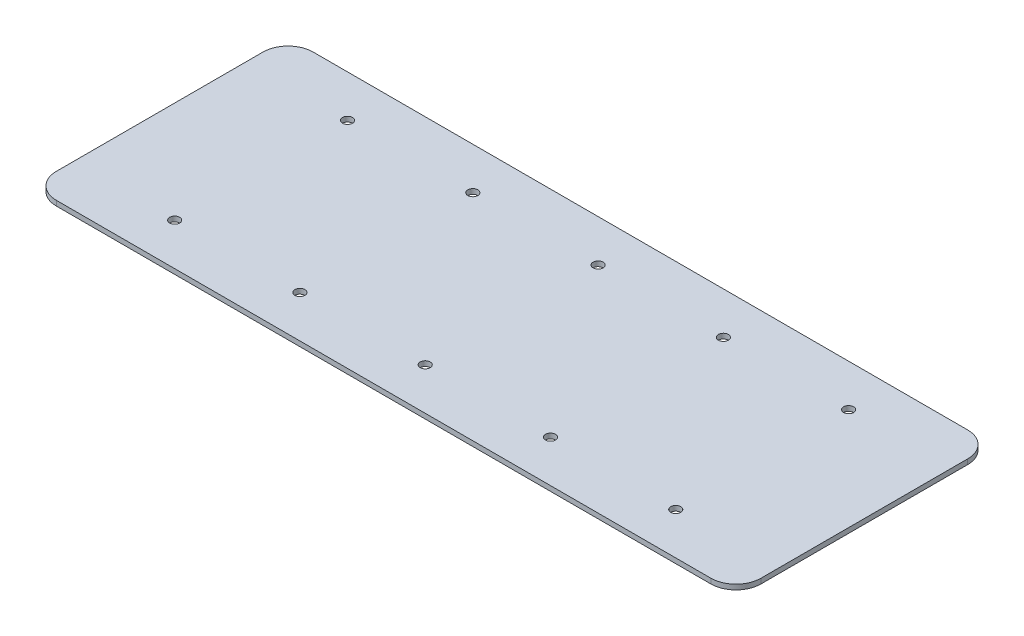
ISO-10303-21;
HEADER;
FILE_DESCRIPTION(('STEP AP214'),'2;1');
FILE_NAME('part.step','',(''),(''),'','','');
FILE_SCHEMA(('AUTOMOTIVE_DESIGN { 1 0 10303 214 1 1 1 1 }'));
ENDSEC;
DATA;
#1=APPLICATION_CONTEXT('core data for automotive mechanical design processes');
#2=APPLICATION_PROTOCOL_DEFINITION('international standard','automotive_design',2000,#1);
#3=PRODUCT_CONTEXT('',#1,'mechanical');
#4=PRODUCT('Part','Part','',(#3));
#5=PRODUCT_RELATED_PRODUCT_CATEGORY('part','',(#4));
#6=PRODUCT_DEFINITION_FORMATION('','',#4);
#7=PRODUCT_DEFINITION_CONTEXT('part definition',#1,'design');
#8=PRODUCT_DEFINITION('design','',#6,#7);
#9=PRODUCT_DEFINITION_SHAPE('','',#8);
#10=(LENGTH_UNIT() NAMED_UNIT(*) SI_UNIT(.MILLI.,.METRE.));
#11=(NAMED_UNIT(*) PLANE_ANGLE_UNIT() SI_UNIT($,.RADIAN.));
#12=(NAMED_UNIT(*) SI_UNIT($,.STERADIAN.) SOLID_ANGLE_UNIT());
#13=UNCERTAINTY_MEASURE_WITH_UNIT(LENGTH_MEASURE(1.E-05),#10,'distance_accuracy_value','');
#14=(GEOMETRIC_REPRESENTATION_CONTEXT(3) GLOBAL_UNCERTAINTY_ASSIGNED_CONTEXT((#13)) GLOBAL_UNIT_ASSIGNED_CONTEXT((#10,
#11,#12)) REPRESENTATION_CONTEXT('',''));
#15=CARTESIAN_POINT('',(0.,0.,0.));
#16=DIRECTION('',(0.,0.,1.));
#17=DIRECTION('',(1.,0.,0.));
#18=AXIS2_PLACEMENT_3D('',#15,#16,#17);
#19=CARTESIAN_POINT('',(112.5,1.6,41.));
#20=DIRECTION('',(-1.,0.,0.));
#21=DIRECTION('',(0.,0.,1.));
#22=AXIS2_PLACEMENT_3D('',#19,#20,#21);
#23=PLANE('',#22);
#24=DIRECTION('',(0.,0.,-1.));
#25=VECTOR('',#24,1.);
#26=CARTESIAN_POINT('',(112.5,0.,41.));
#27=LINE('',#26,#25);
#28=CARTESIAN_POINT('',(112.5,0.,33.));
#29=VERTEX_POINT('',#28);
#30=CARTESIAN_POINT('',(112.5,0.,-33.));
#31=VERTEX_POINT('',#30);
#32=EDGE_CURVE('E134',#29,#31,#27,.T.);
#33=ORIENTED_EDGE('',*,*,#32,.T.);
#34=DIRECTION('',(0.,-1.,0.));
#35=VECTOR('',#34,1.);
#36=CARTESIAN_POINT('',(112.5,1.6,-33.));
#37=LINE('',#36,#35);
#38=CARTESIAN_POINT('',(112.5,1.6,-33.));
#39=VERTEX_POINT('',#38);
#40=EDGE_CURVE('E111',#31,#39,#37,.F.);
#41=ORIENTED_EDGE('',*,*,#40,.T.);
#42=DIRECTION('',(0.,0.,-1.));
#43=VECTOR('',#42,1.);
#44=CARTESIAN_POINT('',(112.5,1.6,41.));
#45=LINE('',#44,#43);
#46=CARTESIAN_POINT('',(112.5,1.6,33.));
#47=VERTEX_POINT('',#46);
#48=EDGE_CURVE('E144',#47,#39,#45,.T.);
#49=ORIENTED_EDGE('',*,*,#48,.F.);
#50=DIRECTION('',(0.,-1.,0.));
#51=VECTOR('',#50,1.);
#52=CARTESIAN_POINT('',(112.5,1.6,33.));
#53=LINE('',#52,#51);
#54=EDGE_CURVE('E116',#47,#29,#53,.T.);
#55=ORIENTED_EDGE('',*,*,#54,.T.);
#56=EDGE_LOOP('',(#33,#41,#49,#55));
#57=FACE_BOUND('',#56,.T.);
#58=ADVANCED_FACE('F39',(#57),#23,.F.);
#59=CARTESIAN_POINT('',(-112.5,1.6,-41.));
#60=DIRECTION('',(0.,0.,1.));
#61=DIRECTION('',(1.,0.,0.));
#62=AXIS2_PLACEMENT_3D('',#59,#60,#61);
#63=PLANE('',#62);
#64=DIRECTION('',(-1.,0.,0.));
#65=VECTOR('',#64,1.);
#66=CARTESIAN_POINT('',(-112.5,1.6,-41.));
#67=LINE('',#66,#65);
#68=CARTESIAN_POINT('',(104.5,1.6,-41.));
#69=VERTEX_POINT('',#68);
#70=CARTESIAN_POINT('',(-104.5,1.6,-41.));
#71=VERTEX_POINT('',#70);
#72=EDGE_CURVE('E126',#69,#71,#67,.T.);
#73=ORIENTED_EDGE('',*,*,#72,.F.);
#74=DIRECTION('',(0.,-1.,0.));
#75=VECTOR('',#74,1.);
#76=CARTESIAN_POINT('',(104.5,1.6,-41.));
#77=LINE('',#76,#75);
#78=CARTESIAN_POINT('',(104.5,0.,-41.));
#79=VERTEX_POINT('',#78);
#80=EDGE_CURVE('E110',#69,#79,#77,.T.);
#81=ORIENTED_EDGE('',*,*,#80,.T.);
#82=DIRECTION('',(-1.,0.,0.));
#83=VECTOR('',#82,1.);
#84=CARTESIAN_POINT('',(-112.5,0.,-41.));
#85=LINE('',#84,#83);
#86=CARTESIAN_POINT('',(-104.5,0.,-41.));
#87=VERTEX_POINT('',#86);
#88=EDGE_CURVE('E123',#79,#87,#85,.T.);
#89=ORIENTED_EDGE('',*,*,#88,.T.);
#90=DIRECTION('',(0.,-1.,0.));
#91=VECTOR('',#90,1.);
#92=CARTESIAN_POINT('',(-104.5,1.6,-41.));
#93=LINE('',#92,#91);
#94=EDGE_CURVE('E128',#87,#71,#93,.F.);
#95=ORIENTED_EDGE('',*,*,#94,.T.);
#96=EDGE_LOOP('',(#73,#81,#89,#95));
#97=FACE_BOUND('',#96,.T.);
#98=ADVANCED_FACE('F122',(#97),#63,.F.);
#99=CARTESIAN_POINT('',(-112.5,1.6,41.));
#100=DIRECTION('',(1.,0.,0.));
#101=DIRECTION('',(0.,0.,-1.));
#102=AXIS2_PLACEMENT_3D('',#99,#100,#101);
#103=PLANE('',#102);
#104=DIRECTION('',(0.,0.,1.));
#105=VECTOR('',#104,1.);
#106=CARTESIAN_POINT('',(-112.5,1.6,41.));
#107=LINE('',#106,#105);
#108=CARTESIAN_POINT('',(-112.5,1.6,-33.));
#109=VERTEX_POINT('',#108);
#110=CARTESIAN_POINT('',(-112.5,1.6,33.));
#111=VERTEX_POINT('',#110);
#112=EDGE_CURVE('E167',#109,#111,#107,.T.);
#113=ORIENTED_EDGE('',*,*,#112,.F.);
#114=DIRECTION('',(0.,-1.,0.));
#115=VECTOR('',#114,1.);
#116=CARTESIAN_POINT('',(-112.5,1.6,-33.));
#117=LINE('',#116,#115);
#118=CARTESIAN_POINT('',(-112.5,0.,-33.));
#119=VERTEX_POINT('',#118);
#120=EDGE_CURVE('E11',#109,#119,#117,.T.);
#121=ORIENTED_EDGE('',*,*,#120,.T.);
#122=DIRECTION('',(0.,0.,1.));
#123=VECTOR('',#122,1.);
#124=CARTESIAN_POINT('',(-112.5,0.,41.));
#125=LINE('',#124,#123);
#126=CARTESIAN_POINT('',(-112.5,0.,33.));
#127=VERTEX_POINT('',#126);
#128=EDGE_CURVE('E133',#119,#127,#125,.T.);
#129=ORIENTED_EDGE('',*,*,#128,.T.);
#130=DIRECTION('',(0.,-1.,0.));
#131=VECTOR('',#130,1.);
#132=CARTESIAN_POINT('',(-112.5,1.6,33.));
#133=LINE('',#132,#131);
#134=EDGE_CURVE('E47',#127,#111,#133,.F.);
#135=ORIENTED_EDGE('',*,*,#134,.T.);
#136=EDGE_LOOP('',(#113,#121,#129,#135));
#137=FACE_BOUND('',#136,.T.);
#138=ADVANCED_FACE('F166',(#137),#103,.F.);
#139=CARTESIAN_POINT('',(-112.5,1.6,41.));
#140=DIRECTION('',(0.,0.,-1.));
#141=DIRECTION('',(-1.,0.,0.));
#142=AXIS2_PLACEMENT_3D('',#139,#140,#141);
#143=PLANE('',#142);
#144=DIRECTION('',(1.,0.,0.));
#145=VECTOR('',#144,1.);
#146=CARTESIAN_POINT('',(-112.5,0.,41.));
#147=LINE('',#146,#145);
#148=CARTESIAN_POINT('',(-104.5,0.,41.));
#149=VERTEX_POINT('',#148);
#150=CARTESIAN_POINT('',(104.5,0.,41.));
#151=VERTEX_POINT('',#150);
#152=EDGE_CURVE('E137',#149,#151,#147,.T.);
#153=ORIENTED_EDGE('',*,*,#152,.T.);
#154=DIRECTION('',(0.,-1.,0.));
#155=VECTOR('',#154,1.);
#156=CARTESIAN_POINT('',(104.5,1.6,41.));
#157=LINE('',#156,#155);
#158=CARTESIAN_POINT('',(104.5,1.6,41.));
#159=VERTEX_POINT('',#158);
#160=EDGE_CURVE('E54',#151,#159,#157,.F.);
#161=ORIENTED_EDGE('',*,*,#160,.T.);
#162=DIRECTION('',(1.,0.,0.));
#163=VECTOR('',#162,1.);
#164=CARTESIAN_POINT('',(-112.5,1.6,41.));
#165=LINE('',#164,#163);
#166=CARTESIAN_POINT('',(-104.5,1.6,41.));
#167=VERTEX_POINT('',#166);
#168=EDGE_CURVE('E145',#167,#159,#165,.T.);
#169=ORIENTED_EDGE('',*,*,#168,.F.);
#170=DIRECTION('',(0.,-1.,0.));
#171=VECTOR('',#170,1.);
#172=CARTESIAN_POINT('',(-104.5,1.6,41.));
#173=LINE('',#172,#171);
#174=EDGE_CURVE('E160',#167,#149,#173,.T.);
#175=ORIENTED_EDGE('',*,*,#174,.T.);
#176=EDGE_LOOP('',(#153,#161,#169,#175));
#177=FACE_BOUND('',#176,.T.);
#178=ADVANCED_FACE('F176',(#177),#143,.F.);
#179=CARTESIAN_POINT('',(0.,1.6,0.));
#180=DIRECTION('',(0.,-1.,0.));
#181=DIRECTION('',(0.,0.,-1.));
#182=AXIS2_PLACEMENT_3D('',#179,#180,#181);
#183=PLANE('',#182);
#184=CARTESIAN_POINT('',(79.89,1.6,27.6000000000003));
#185=DIRECTION('',(0.,-1.,0.));
#186=DIRECTION('',(0.,0.,-1.));
#187=AXIS2_PLACEMENT_3D('',#184,#185,#186);
#188=CIRCLE('',#187,1.6);
#189=CARTESIAN_POINT('',(79.89,1.6,26.0000000000003));
#190=VERTEX_POINT('',#189);
#191=EDGE_CURVE('E139',#190,#190,#188,.T.);
#192=ORIENTED_EDGE('',*,*,#191,.T.);
#193=EDGE_LOOP('',(#192));
#194=FACE_BOUND('',#193,.T.);
#195=CARTESIAN_POINT('',(39.89,1.6,27.6000000000003));
#196=DIRECTION('',(0.,-1.,0.));
#197=DIRECTION('',(0.,0.,-1.));
#198=AXIS2_PLACEMENT_3D('',#195,#196,#197);
#199=CIRCLE('',#198,1.6);
#200=CARTESIAN_POINT('',(39.89,1.6,26.0000000000003));
#201=VERTEX_POINT('',#200);
#202=EDGE_CURVE('E188',#201,#201,#199,.T.);
#203=ORIENTED_EDGE('',*,*,#202,.T.);
#204=EDGE_LOOP('',(#203));
#205=FACE_BOUND('',#204,.T.);
#206=CARTESIAN_POINT('',(-0.109999999999954,1.6,27.6000000000003));
#207=DIRECTION('',(0.,-1.,0.));
#208=DIRECTION('',(0.,0.,-1.));
#209=AXIS2_PLACEMENT_3D('',#206,#207,#208);
#210=CIRCLE('',#209,1.6);
#211=CARTESIAN_POINT('',(-0.109999999999954,1.6,26.0000000000003));
#212=VERTEX_POINT('',#211);
#213=EDGE_CURVE('E191',#212,#212,#210,.T.);
#214=ORIENTED_EDGE('',*,*,#213,.T.);
#215=EDGE_LOOP('',(#214));
#216=FACE_BOUND('',#215,.T.);
#217=CARTESIAN_POINT('',(-40.1099999999999,1.6,27.6000000000003));
#218=DIRECTION('',(0.,-1.,0.));
#219=DIRECTION('',(0.,0.,-1.));
#220=AXIS2_PLACEMENT_3D('',#217,#218,#219);
#221=CIRCLE('',#220,1.6);
#222=CARTESIAN_POINT('',(-40.1099999999999,1.6,26.0000000000003));
#223=VERTEX_POINT('',#222);
#224=EDGE_CURVE('E194',#223,#223,#221,.T.);
#225=ORIENTED_EDGE('',*,*,#224,.T.);
#226=EDGE_LOOP('',(#225));
#227=FACE_BOUND('',#226,.T.);
#228=CARTESIAN_POINT('',(39.8899999999998,1.6,-27.5999999999997));
#229=DIRECTION('',(0.,-1.,0.));
#230=DIRECTION('',(0.,0.,-1.));
#231=AXIS2_PLACEMENT_3D('',#228,#229,#230);
#232=CIRCLE('',#231,1.6);
#233=CARTESIAN_POINT('',(39.8899999999998,1.6,-29.1999999999997));
#234=VERTEX_POINT('',#233);
#235=EDGE_CURVE('E197',#234,#234,#232,.T.);
#236=ORIENTED_EDGE('',*,*,#235,.T.);
#237=EDGE_LOOP('',(#236));
#238=FACE_BOUND('',#237,.T.);
#239=CARTESIAN_POINT('',(-0.110000000000148,1.6,-27.5999999999997));
#240=DIRECTION('',(0.,-1.,0.));
#241=DIRECTION('',(0.,0.,-1.));
#242=AXIS2_PLACEMENT_3D('',#239,#240,#241);
#243=CIRCLE('',#242,1.6);
#244=CARTESIAN_POINT('',(-0.110000000000148,1.6,-29.1999999999997));
#245=VERTEX_POINT('',#244);
#246=EDGE_CURVE('E200',#245,#245,#243,.T.);
#247=ORIENTED_EDGE('',*,*,#246,.T.);
#248=EDGE_LOOP('',(#247));
#249=FACE_BOUND('',#248,.T.);
#250=CARTESIAN_POINT('',(-40.1100000000001,1.6,-27.5999999999997));
#251=DIRECTION('',(0.,-1.,0.));
#252=DIRECTION('',(0.,0.,-1.));
#253=AXIS2_PLACEMENT_3D('',#250,#251,#252);
#254=CIRCLE('',#253,1.6);
#255=CARTESIAN_POINT('',(-40.1100000000001,1.6,-29.1999999999997));
#256=VERTEX_POINT('',#255);
#257=EDGE_CURVE('E203',#256,#256,#254,.T.);
#258=ORIENTED_EDGE('',*,*,#257,.T.);
#259=EDGE_LOOP('',(#258));
#260=FACE_BOUND('',#259,.T.);
#261=CARTESIAN_POINT('',(-80.1099999999999,1.6,27.6000000000003));
#262=DIRECTION('',(0.,-1.,0.));
#263=DIRECTION('',(0.,0.,-1.));
#264=AXIS2_PLACEMENT_3D('',#261,#262,#263);
#265=CIRCLE('',#264,1.6);
#266=CARTESIAN_POINT('',(-80.1099999999999,1.6,26.0000000000003));
#267=VERTEX_POINT('',#266);
#268=EDGE_CURVE('E206',#267,#267,#265,.T.);
#269=ORIENTED_EDGE('',*,*,#268,.T.);
#270=EDGE_LOOP('',(#269));
#271=FACE_BOUND('',#270,.T.);
#272=CARTESIAN_POINT('',(79.8899999999998,1.6,-27.5999999999997));
#273=DIRECTION('',(0.,-1.,0.));
#274=DIRECTION('',(0.,0.,-1.));
#275=AXIS2_PLACEMENT_3D('',#272,#273,#274);
#276=CIRCLE('',#275,1.6);
#277=CARTESIAN_POINT('',(79.8899999999998,1.6,-29.1999999999997));
#278=VERTEX_POINT('',#277);
#279=EDGE_CURVE('E209',#278,#278,#276,.T.);
#280=ORIENTED_EDGE('',*,*,#279,.T.);
#281=EDGE_LOOP('',(#280));
#282=FACE_BOUND('',#281,.T.);
#283=CARTESIAN_POINT('',(-80.1100000000001,1.6,-27.5999999999997));
#284=DIRECTION('',(0.,-1.,0.));
#285=DIRECTION('',(0.,0.,-1.));
#286=AXIS2_PLACEMENT_3D('',#283,#284,#285);
#287=CIRCLE('',#286,1.6);
#288=CARTESIAN_POINT('',(-80.1100000000001,1.6,-29.1999999999997));
#289=VERTEX_POINT('',#288);
#290=EDGE_CURVE('E212',#289,#289,#287,.T.);
#291=ORIENTED_EDGE('',*,*,#290,.T.);
#292=EDGE_LOOP('',(#291));
#293=FACE_BOUND('',#292,.T.);
#294=ORIENTED_EDGE('',*,*,#48,.T.);
#295=CARTESIAN_POINT('',(104.5,1.6,-33.));
#296=DIRECTION('',(0.,-1.,0.));
#297=DIRECTION('',(0.,0.,-1.));
#298=AXIS2_PLACEMENT_3D('',#295,#296,#297);
#299=CIRCLE('',#298,8.);
#300=EDGE_CURVE('E158',#39,#69,#299,.F.);
#301=ORIENTED_EDGE('',*,*,#300,.T.);
#302=ORIENTED_EDGE('',*,*,#72,.T.);
#303=CARTESIAN_POINT('',(-104.5,1.6,-33.));
#304=DIRECTION('',(0.,-1.,0.));
#305=DIRECTION('',(0.,0.,-1.));
#306=AXIS2_PLACEMENT_3D('',#303,#304,#305);
#307=CIRCLE('',#306,8.);
#308=EDGE_CURVE('E154',#71,#109,#307,.F.);
#309=ORIENTED_EDGE('',*,*,#308,.T.);
#310=ORIENTED_EDGE('',*,*,#112,.T.);
#311=CARTESIAN_POINT('',(-104.5,1.6,33.));
#312=DIRECTION('',(0.,-1.,0.));
#313=DIRECTION('',(0.,0.,-1.));
#314=AXIS2_PLACEMENT_3D('',#311,#312,#313);
#315=CIRCLE('',#314,8.);
#316=EDGE_CURVE('E61',#111,#167,#315,.F.);
#317=ORIENTED_EDGE('',*,*,#316,.T.);
#318=ORIENTED_EDGE('',*,*,#168,.T.);
#319=CARTESIAN_POINT('',(104.5,1.6,33.));
#320=DIRECTION('',(0.,-1.,0.));
#321=DIRECTION('',(0.,0.,-1.));
#322=AXIS2_PLACEMENT_3D('',#319,#320,#321);
#323=CIRCLE('',#322,8.);
#324=EDGE_CURVE('E156',#159,#47,#323,.F.);
#325=ORIENTED_EDGE('',*,*,#324,.T.);
#326=EDGE_LOOP('',(#294,#301,#302,#309,#310,#317,#318,#325));
#327=FACE_BOUND('',#326,.T.);
#328=ADVANCED_FACE('F171',(#194,#205,#216,#227,#238,#249,#260,#271,#282,#293,#327),#183,.F.);
#329=CARTESIAN_POINT('',(0.,0.,0.));
#330=DIRECTION('',(0.,-1.,0.));
#331=DIRECTION('',(0.,0.,-1.));
#332=AXIS2_PLACEMENT_3D('',#329,#330,#331);
#333=PLANE('',#332);
#334=CARTESIAN_POINT('',(79.89,0.,27.6000000000003));
#335=DIRECTION('',(0.,1.,0.));
#336=DIRECTION('',(0.,0.,1.));
#337=AXIS2_PLACEMENT_3D('',#334,#335,#336);
#338=CIRCLE('',#337,1.6);
#339=CARTESIAN_POINT('',(79.89,0.,29.2000000000003));
#340=VERTEX_POINT('',#339);
#341=EDGE_CURVE('E231',#340,#340,#338,.T.);
#342=ORIENTED_EDGE('',*,*,#341,.T.);
#343=EDGE_LOOP('',(#342));
#344=FACE_BOUND('',#343,.T.);
#345=CARTESIAN_POINT('',(39.89,0.,27.6000000000003));
#346=DIRECTION('',(0.,1.,0.));
#347=DIRECTION('',(0.,0.,1.));
#348=AXIS2_PLACEMENT_3D('',#345,#346,#347);
#349=CIRCLE('',#348,1.6);
#350=CARTESIAN_POINT('',(39.89,0.,29.2000000000003));
#351=VERTEX_POINT('',#350);
#352=EDGE_CURVE('E234',#351,#351,#349,.T.);
#353=ORIENTED_EDGE('',*,*,#352,.T.);
#354=EDGE_LOOP('',(#353));
#355=FACE_BOUND('',#354,.T.);
#356=CARTESIAN_POINT('',(-0.109999999999954,0.,27.6000000000003));
#357=DIRECTION('',(0.,1.,0.));
#358=DIRECTION('',(0.,0.,1.));
#359=AXIS2_PLACEMENT_3D('',#356,#357,#358);
#360=CIRCLE('',#359,1.6);
#361=CARTESIAN_POINT('',(-0.109999999999954,0.,29.2000000000003));
#362=VERTEX_POINT('',#361);
#363=EDGE_CURVE('E238',#362,#362,#360,.T.);
#364=ORIENTED_EDGE('',*,*,#363,.T.);
#365=EDGE_LOOP('',(#364));
#366=FACE_BOUND('',#365,.T.);
#367=CARTESIAN_POINT('',(-40.1099999999999,0.,27.6000000000003));
#368=DIRECTION('',(0.,1.,0.));
#369=DIRECTION('',(0.,0.,1.));
#370=AXIS2_PLACEMENT_3D('',#367,#368,#369);
#371=CIRCLE('',#370,1.6);
#372=CARTESIAN_POINT('',(-40.1099999999999,0.,29.2000000000003));
#373=VERTEX_POINT('',#372);
#374=EDGE_CURVE('E223',#373,#373,#371,.T.);
#375=ORIENTED_EDGE('',*,*,#374,.T.);
#376=EDGE_LOOP('',(#375));
#377=FACE_BOUND('',#376,.T.);
#378=CARTESIAN_POINT('',(39.8899999999998,0.,-27.5999999999997));
#379=DIRECTION('',(0.,1.,0.));
#380=DIRECTION('',(0.,0.,1.));
#381=AXIS2_PLACEMENT_3D('',#378,#379,#380);
#382=CIRCLE('',#381,1.6);
#383=CARTESIAN_POINT('',(39.8899999999998,0.,-25.9999999999997));
#384=VERTEX_POINT('',#383);
#385=EDGE_CURVE('E219',#384,#384,#382,.T.);
#386=ORIENTED_EDGE('',*,*,#385,.T.);
#387=EDGE_LOOP('',(#386));
#388=FACE_BOUND('',#387,.T.);
#389=CARTESIAN_POINT('',(-0.110000000000148,0.,-27.5999999999997));
#390=DIRECTION('',(0.,1.,0.));
#391=DIRECTION('',(0.,0.,1.));
#392=AXIS2_PLACEMENT_3D('',#389,#390,#391);
#393=CIRCLE('',#392,1.6);
#394=CARTESIAN_POINT('',(-0.110000000000148,0.,-25.9999999999997));
#395=VERTEX_POINT('',#394);
#396=EDGE_CURVE('E222',#395,#395,#393,.T.);
#397=ORIENTED_EDGE('',*,*,#396,.T.);
#398=EDGE_LOOP('',(#397));
#399=FACE_BOUND('',#398,.T.);
#400=CARTESIAN_POINT('',(-40.1100000000001,0.,-27.5999999999997));
#401=DIRECTION('',(0.,1.,0.));
#402=DIRECTION('',(0.,0.,1.));
#403=AXIS2_PLACEMENT_3D('',#400,#401,#402);
#404=CIRCLE('',#403,1.6);
#405=CARTESIAN_POINT('',(-40.1100000000001,0.,-25.9999999999997));
#406=VERTEX_POINT('',#405);
#407=EDGE_CURVE('E226',#406,#406,#404,.T.);
#408=ORIENTED_EDGE('',*,*,#407,.T.);
#409=EDGE_LOOP('',(#408));
#410=FACE_BOUND('',#409,.T.);
#411=CARTESIAN_POINT('',(-80.1099999999999,0.,27.6000000000003));
#412=DIRECTION('',(0.,1.,0.));
#413=DIRECTION('',(0.,0.,1.));
#414=AXIS2_PLACEMENT_3D('',#411,#412,#413);
#415=CIRCLE('',#414,1.6);
#416=CARTESIAN_POINT('',(-80.1099999999999,0.,29.2000000000003));
#417=VERTEX_POINT('',#416);
#418=EDGE_CURVE('E218',#417,#417,#415,.T.);
#419=ORIENTED_EDGE('',*,*,#418,.T.);
#420=EDGE_LOOP('',(#419));
#421=FACE_BOUND('',#420,.T.);
#422=CARTESIAN_POINT('',(79.8899999999998,0.,-27.5999999999997));
#423=DIRECTION('',(0.,1.,0.));
#424=DIRECTION('',(0.,0.,1.));
#425=AXIS2_PLACEMENT_3D('',#422,#423,#424);
#426=CIRCLE('',#425,1.6);
#427=CARTESIAN_POINT('',(79.8899999999998,0.,-25.9999999999997));
#428=VERTEX_POINT('',#427);
#429=EDGE_CURVE('E235',#428,#428,#426,.T.);
#430=ORIENTED_EDGE('',*,*,#429,.T.);
#431=EDGE_LOOP('',(#430));
#432=FACE_BOUND('',#431,.T.);
#433=CARTESIAN_POINT('',(-80.1100000000001,0.,-27.5999999999997));
#434=DIRECTION('',(0.,1.,0.));
#435=DIRECTION('',(0.,0.,1.));
#436=AXIS2_PLACEMENT_3D('',#433,#434,#435);
#437=CIRCLE('',#436,1.6);
#438=CARTESIAN_POINT('',(-80.1100000000001,0.,-25.9999999999997));
#439=VERTEX_POINT('',#438);
#440=EDGE_CURVE('E215',#439,#439,#437,.T.);
#441=ORIENTED_EDGE('',*,*,#440,.T.);
#442=EDGE_LOOP('',(#441));
#443=FACE_BOUND('',#442,.T.);
#444=ORIENTED_EDGE('',*,*,#88,.F.);
#445=CARTESIAN_POINT('',(104.5,0.,-33.));
#446=DIRECTION('',(0.,-1.,0.));
#447=DIRECTION('',(0.,0.,-1.));
#448=AXIS2_PLACEMENT_3D('',#445,#446,#447);
#449=CIRCLE('',#448,8.);
#450=EDGE_CURVE('E106',#79,#31,#449,.T.);
#451=ORIENTED_EDGE('',*,*,#450,.T.);
#452=ORIENTED_EDGE('',*,*,#32,.F.);
#453=CARTESIAN_POINT('',(104.5,0.,33.));
#454=DIRECTION('',(0.,-1.,0.));
#455=DIRECTION('',(0.,0.,-1.));
#456=AXIS2_PLACEMENT_3D('',#453,#454,#455);
#457=CIRCLE('',#456,8.);
#458=EDGE_CURVE('E117',#29,#151,#457,.T.);
#459=ORIENTED_EDGE('',*,*,#458,.T.);
#460=ORIENTED_EDGE('',*,*,#152,.F.);
#461=CARTESIAN_POINT('',(-104.5,0.,33.));
#462=DIRECTION('',(0.,-1.,0.));
#463=DIRECTION('',(0.,0.,-1.));
#464=AXIS2_PLACEMENT_3D('',#461,#462,#463);
#465=CIRCLE('',#464,8.);
#466=EDGE_CURVE('E127',#149,#127,#465,.T.);
#467=ORIENTED_EDGE('',*,*,#466,.T.);
#468=ORIENTED_EDGE('',*,*,#128,.F.);
#469=CARTESIAN_POINT('',(-104.5,0.,-33.));
#470=DIRECTION('',(0.,-1.,0.));
#471=DIRECTION('',(0.,0.,-1.));
#472=AXIS2_PLACEMENT_3D('',#469,#470,#471);
#473=CIRCLE('',#472,8.);
#474=EDGE_CURVE('E132',#119,#87,#473,.T.);
#475=ORIENTED_EDGE('',*,*,#474,.T.);
#476=EDGE_LOOP('',(#444,#451,#452,#459,#460,#467,#468,#475));
#477=FACE_BOUND('',#476,.T.);
#478=ADVANCED_FACE('F130',(#344,#355,#366,#377,#388,#399,#410,#421,#432,#443,#477),#333,.T.);
#479=CARTESIAN_POINT('',(104.5,1.6,-33.));
#480=DIRECTION('',(0.,-1.,0.));
#481=DIRECTION('',(0.,0.,-1.));
#482=AXIS2_PLACEMENT_3D('',#479,#480,#481);
#483=CYLINDRICAL_SURFACE('',#482,8.);
#484=ORIENTED_EDGE('',*,*,#300,.F.);
#485=ORIENTED_EDGE('',*,*,#40,.F.);
#486=ORIENTED_EDGE('',*,*,#450,.F.);
#487=ORIENTED_EDGE('',*,*,#80,.F.);
#488=EDGE_LOOP('',(#484,#485,#486,#487));
#489=FACE_BOUND('',#488,.T.);
#490=ADVANCED_FACE('F109',(#489),#483,.T.);
#491=CARTESIAN_POINT('',(104.5,1.6,33.));
#492=DIRECTION('',(0.,-1.,0.));
#493=DIRECTION('',(0.,0.,-1.));
#494=AXIS2_PLACEMENT_3D('',#491,#492,#493);
#495=CYLINDRICAL_SURFACE('',#494,8.);
#496=ORIENTED_EDGE('',*,*,#324,.F.);
#497=ORIENTED_EDGE('',*,*,#160,.F.);
#498=ORIENTED_EDGE('',*,*,#458,.F.);
#499=ORIENTED_EDGE('',*,*,#54,.F.);
#500=EDGE_LOOP('',(#496,#497,#498,#499));
#501=FACE_BOUND('',#500,.T.);
#502=ADVANCED_FACE('F180',(#501),#495,.T.);
#503=CARTESIAN_POINT('',(-104.5,1.6,-33.));
#504=DIRECTION('',(0.,-1.,0.));
#505=DIRECTION('',(0.,0.,-1.));
#506=AXIS2_PLACEMENT_3D('',#503,#504,#505);
#507=CYLINDRICAL_SURFACE('',#506,8.);
#508=ORIENTED_EDGE('',*,*,#308,.F.);
#509=ORIENTED_EDGE('',*,*,#94,.F.);
#510=ORIENTED_EDGE('',*,*,#474,.F.);
#511=ORIENTED_EDGE('',*,*,#120,.F.);
#512=EDGE_LOOP('',(#508,#509,#510,#511));
#513=FACE_BOUND('',#512,.T.);
#514=ADVANCED_FACE('F268',(#513),#507,.T.);
#515=CARTESIAN_POINT('',(-104.5,1.6,33.));
#516=DIRECTION('',(0.,-1.,0.));
#517=DIRECTION('',(0.,0.,-1.));
#518=AXIS2_PLACEMENT_3D('',#515,#516,#517);
#519=CYLINDRICAL_SURFACE('',#518,8.);
#520=ORIENTED_EDGE('',*,*,#316,.F.);
#521=ORIENTED_EDGE('',*,*,#134,.F.);
#522=ORIENTED_EDGE('',*,*,#466,.F.);
#523=ORIENTED_EDGE('',*,*,#174,.F.);
#524=EDGE_LOOP('',(#520,#521,#522,#523));
#525=FACE_BOUND('',#524,.T.);
#526=ADVANCED_FACE('F41',(#525),#519,.T.);
#527=CARTESIAN_POINT('',(-80.1100000000001,0.,-27.5999999999997));
#528=DIRECTION('',(0.,1.,0.));
#529=DIRECTION('',(0.,0.,1.));
#530=AXIS2_PLACEMENT_3D('',#527,#528,#529);
#531=CYLINDRICAL_SURFACE('',#530,1.6);
#532=ORIENTED_EDGE('',*,*,#440,.F.);
#533=EDGE_LOOP('',(#532));
#534=FACE_BOUND('',#533,.T.);
#535=ORIENTED_EDGE('',*,*,#290,.F.);
#536=EDGE_LOOP('',(#535));
#537=FACE_BOUND('',#536,.T.);
#538=ADVANCED_FACE('F252',(#534,#537),#531,.F.);
#539=CARTESIAN_POINT('',(79.8899999999998,0.,-27.5999999999997));
#540=DIRECTION('',(0.,1.,0.));
#541=DIRECTION('',(0.,0.,1.));
#542=AXIS2_PLACEMENT_3D('',#539,#540,#541);
#543=CYLINDRICAL_SURFACE('',#542,1.6);
#544=ORIENTED_EDGE('',*,*,#429,.F.);
#545=EDGE_LOOP('',(#544));
#546=FACE_BOUND('',#545,.T.);
#547=ORIENTED_EDGE('',*,*,#279,.F.);
#548=EDGE_LOOP('',(#547));
#549=FACE_BOUND('',#548,.T.);
#550=ADVANCED_FACE('F248',(#546,#549),#543,.F.);
#551=CARTESIAN_POINT('',(-80.1099999999999,0.,27.6000000000003));
#552=DIRECTION('',(0.,1.,0.));
#553=DIRECTION('',(0.,0.,1.));
#554=AXIS2_PLACEMENT_3D('',#551,#552,#553);
#555=CYLINDRICAL_SURFACE('',#554,1.6);
#556=ORIENTED_EDGE('',*,*,#418,.F.);
#557=EDGE_LOOP('',(#556));
#558=FACE_BOUND('',#557,.T.);
#559=ORIENTED_EDGE('',*,*,#268,.F.);
#560=EDGE_LOOP('',(#559));
#561=FACE_BOUND('',#560,.T.);
#562=ADVANCED_FACE('F251',(#558,#561),#555,.F.);
#563=CARTESIAN_POINT('',(-40.1100000000001,0.,-27.5999999999997));
#564=DIRECTION('',(0.,1.,0.));
#565=DIRECTION('',(0.,0.,1.));
#566=AXIS2_PLACEMENT_3D('',#563,#564,#565);
#567=CYLINDRICAL_SURFACE('',#566,1.6);
#568=ORIENTED_EDGE('',*,*,#407,.F.);
#569=EDGE_LOOP('',(#568));
#570=FACE_BOUND('',#569,.T.);
#571=ORIENTED_EDGE('',*,*,#257,.F.);
#572=EDGE_LOOP('',(#571));
#573=FACE_BOUND('',#572,.T.);
#574=ADVANCED_FACE('F334',(#570,#573),#567,.F.);
#575=CARTESIAN_POINT('',(-0.110000000000148,0.,-27.5999999999997));
#576=DIRECTION('',(0.,1.,0.));
#577=DIRECTION('',(0.,0.,1.));
#578=AXIS2_PLACEMENT_3D('',#575,#576,#577);
#579=CYLINDRICAL_SURFACE('',#578,1.6);
#580=ORIENTED_EDGE('',*,*,#396,.F.);
#581=EDGE_LOOP('',(#580));
#582=FACE_BOUND('',#581,.T.);
#583=ORIENTED_EDGE('',*,*,#246,.F.);
#584=EDGE_LOOP('',(#583));
#585=FACE_BOUND('',#584,.T.);
#586=ADVANCED_FACE('F345',(#582,#585),#579,.F.);
#587=CARTESIAN_POINT('',(39.8899999999998,0.,-27.5999999999997));
#588=DIRECTION('',(0.,1.,0.));
#589=DIRECTION('',(0.,0.,1.));
#590=AXIS2_PLACEMENT_3D('',#587,#588,#589);
#591=CYLINDRICAL_SURFACE('',#590,1.6);
#592=ORIENTED_EDGE('',*,*,#385,.F.);
#593=EDGE_LOOP('',(#592));
#594=FACE_BOUND('',#593,.T.);
#595=ORIENTED_EDGE('',*,*,#235,.F.);
#596=EDGE_LOOP('',(#595));
#597=FACE_BOUND('',#596,.T.);
#598=ADVANCED_FACE('F356',(#594,#597),#591,.F.);
#599=CARTESIAN_POINT('',(-40.1099999999999,0.,27.6000000000003));
#600=DIRECTION('',(0.,1.,0.));
#601=DIRECTION('',(0.,0.,1.));
#602=AXIS2_PLACEMENT_3D('',#599,#600,#601);
#603=CYLINDRICAL_SURFACE('',#602,1.6);
#604=ORIENTED_EDGE('',*,*,#374,.F.);
#605=EDGE_LOOP('',(#604));
#606=FACE_BOUND('',#605,.T.);
#607=ORIENTED_EDGE('',*,*,#224,.F.);
#608=EDGE_LOOP('',(#607));
#609=FACE_BOUND('',#608,.T.);
#610=ADVANCED_FACE('F367',(#606,#609),#603,.F.);
#611=CARTESIAN_POINT('',(-0.109999999999954,0.,27.6000000000003));
#612=DIRECTION('',(0.,1.,0.));
#613=DIRECTION('',(0.,0.,1.));
#614=AXIS2_PLACEMENT_3D('',#611,#612,#613);
#615=CYLINDRICAL_SURFACE('',#614,1.6);
#616=ORIENTED_EDGE('',*,*,#363,.F.);
#617=EDGE_LOOP('',(#616));
#618=FACE_BOUND('',#617,.T.);
#619=ORIENTED_EDGE('',*,*,#213,.F.);
#620=EDGE_LOOP('',(#619));
#621=FACE_BOUND('',#620,.T.);
#622=ADVANCED_FACE('F377',(#618,#621),#615,.F.);
#623=CARTESIAN_POINT('',(39.89,0.,27.6000000000003));
#624=DIRECTION('',(0.,1.,0.));
#625=DIRECTION('',(0.,0.,1.));
#626=AXIS2_PLACEMENT_3D('',#623,#624,#625);
#627=CYLINDRICAL_SURFACE('',#626,1.6);
#628=ORIENTED_EDGE('',*,*,#352,.F.);
#629=EDGE_LOOP('',(#628));
#630=FACE_BOUND('',#629,.T.);
#631=ORIENTED_EDGE('',*,*,#202,.F.);
#632=EDGE_LOOP('',(#631));
#633=FACE_BOUND('',#632,.T.);
#634=ADVANCED_FACE('F388',(#630,#633),#627,.F.);
#635=CARTESIAN_POINT('',(79.89,0.,27.6000000000003));
#636=DIRECTION('',(0.,1.,0.));
#637=DIRECTION('',(0.,0.,1.));
#638=AXIS2_PLACEMENT_3D('',#635,#636,#637);
#639=CYLINDRICAL_SURFACE('',#638,1.6);
#640=ORIENTED_EDGE('',*,*,#341,.F.);
#641=EDGE_LOOP('',(#640));
#642=FACE_BOUND('',#641,.T.);
#643=ORIENTED_EDGE('',*,*,#191,.F.);
#644=EDGE_LOOP('',(#643));
#645=FACE_BOUND('',#644,.T.);
#646=ADVANCED_FACE('F399',(#642,#645),#639,.F.);
#647=CLOSED_SHELL('',(#58,#98,#138,#178,#328,#478,#490,#502,#514,#526,#538,#550,#562,#574,#586,
#598,#610,#622,#634,#646));
#648=MANIFOLD_SOLID_BREP('B2',#647);
#649=ADVANCED_BREP_SHAPE_REPRESENTATION('',(#18,#648),#14);
#650=SHAPE_DEFINITION_REPRESENTATION(#9,#649);
ENDSEC;
END-ISO-10303-21;
